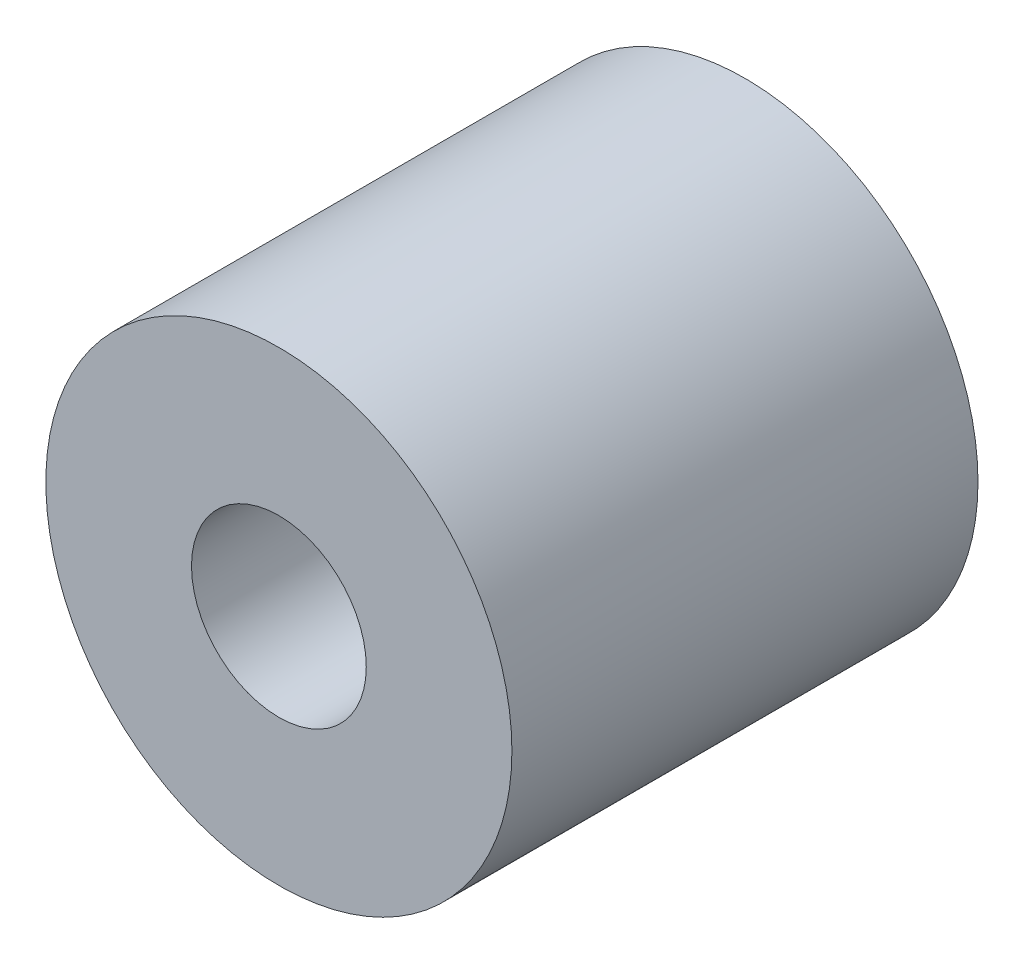
ISO-10303-21;
HEADER;
FILE_DESCRIPTION(('STEP AP214'),'2;1');
FILE_NAME('part.step','',(''),(''),'','','');
FILE_SCHEMA(('AUTOMOTIVE_DESIGN { 1 0 10303 214 1 1 1 1 }'));
ENDSEC;
DATA;
#1=APPLICATION_CONTEXT('core data for automotive mechanical design processes');
#2=APPLICATION_PROTOCOL_DEFINITION('international standard','automotive_design',2000,#1);
#3=PRODUCT_CONTEXT('',#1,'mechanical');
#4=PRODUCT('Part','Part','',(#3));
#5=PRODUCT_RELATED_PRODUCT_CATEGORY('part','',(#4));
#6=PRODUCT_DEFINITION_FORMATION('','',#4);
#7=PRODUCT_DEFINITION_CONTEXT('part definition',#1,'design');
#8=PRODUCT_DEFINITION('design','',#6,#7);
#9=PRODUCT_DEFINITION_SHAPE('','',#8);
#10=(LENGTH_UNIT() NAMED_UNIT(*) SI_UNIT(.MILLI.,.METRE.));
#11=(NAMED_UNIT(*) PLANE_ANGLE_UNIT() SI_UNIT($,.RADIAN.));
#12=(NAMED_UNIT(*) SI_UNIT($,.STERADIAN.) SOLID_ANGLE_UNIT());
#13=UNCERTAINTY_MEASURE_WITH_UNIT(LENGTH_MEASURE(1.E-05),#10,'distance_accuracy_value','');
#14=(GEOMETRIC_REPRESENTATION_CONTEXT(3) GLOBAL_UNCERTAINTY_ASSIGNED_CONTEXT((#13)) GLOBAL_UNIT_ASSIGNED_CONTEXT((#10,
#11,#12)) REPRESENTATION_CONTEXT('',''));
#15=CARTESIAN_POINT('',(0.,0.,0.));
#16=DIRECTION('',(0.,0.,1.));
#17=DIRECTION('',(1.,0.,0.));
#18=AXIS2_PLACEMENT_3D('',#15,#16,#17);
#19=CARTESIAN_POINT('',(0.,0.,8.));
#20=DIRECTION('',(0.,0.,1.));
#21=DIRECTION('',(1.,0.,0.));
#22=AXIS2_PLACEMENT_3D('',#19,#20,#21);
#23=PLANE('',#22);
#24=CARTESIAN_POINT('',(0.,0.,8.));
#25=DIRECTION('',(0.,0.,1.));
#26=DIRECTION('',(1.,0.,0.));
#27=AXIS2_PLACEMENT_3D('',#24,#25,#26);
#28=CIRCLE('',#27,4.);
#29=CARTESIAN_POINT('',(4.,0.,8.));
#30=VERTEX_POINT('',#29);
#31=EDGE_CURVE('E10',#30,#30,#28,.T.);
#32=ORIENTED_EDGE('',*,*,#31,.T.);
#33=EDGE_LOOP('',(#32));
#34=FACE_BOUND('',#33,.T.);
#35=CARTESIAN_POINT('',(0.,0.,8.));
#36=DIRECTION('',(0.,0.,1.));
#37=DIRECTION('',(1.,0.,0.));
#38=AXIS2_PLACEMENT_3D('',#35,#36,#37);
#39=CIRCLE('',#38,1.5);
#40=CARTESIAN_POINT('',(1.5,0.,8.));
#41=VERTEX_POINT('',#40);
#42=EDGE_CURVE('E44',#41,#41,#39,.T.);
#43=ORIENTED_EDGE('',*,*,#42,.F.);
#44=EDGE_LOOP('',(#43));
#45=FACE_BOUND('',#44,.T.);
#46=ADVANCED_FACE('F33',(#34,#45),#23,.T.);
#47=CARTESIAN_POINT('',(0.,0.,0.));
#48=DIRECTION('',(0.,0.,1.));
#49=DIRECTION('',(1.,0.,0.));
#50=AXIS2_PLACEMENT_3D('',#47,#48,#49);
#51=PLANE('',#50);
#52=CARTESIAN_POINT('',(0.,0.,0.));
#53=DIRECTION('',(0.,0.,1.));
#54=DIRECTION('',(1.,0.,0.));
#55=AXIS2_PLACEMENT_3D('',#52,#53,#54);
#56=CIRCLE('',#55,4.);
#57=CARTESIAN_POINT('',(4.,0.,0.));
#58=VERTEX_POINT('',#57);
#59=EDGE_CURVE('E37',#58,#58,#56,.T.);
#60=ORIENTED_EDGE('',*,*,#59,.F.);
#61=EDGE_LOOP('',(#60));
#62=FACE_BOUND('',#61,.T.);
#63=CARTESIAN_POINT('',(0.,0.,0.));
#64=DIRECTION('',(0.,0.,1.));
#65=DIRECTION('',(1.,0.,0.));
#66=AXIS2_PLACEMENT_3D('',#63,#64,#65);
#67=CIRCLE('',#66,1.5);
#68=CARTESIAN_POINT('',(1.5,0.,0.));
#69=VERTEX_POINT('',#68);
#70=EDGE_CURVE('E46',#69,#69,#67,.T.);
#71=ORIENTED_EDGE('',*,*,#70,.T.);
#72=EDGE_LOOP('',(#71));
#73=FACE_BOUND('',#72,.T.);
#74=ADVANCED_FACE('F56',(#62,#73),#51,.F.);
#75=CARTESIAN_POINT('',(0.,0.,8.));
#76=DIRECTION('',(0.,0.,-1.));
#77=DIRECTION('',(-1.,0.,0.));
#78=AXIS2_PLACEMENT_3D('',#75,#76,#77);
#79=CYLINDRICAL_SURFACE('',#78,4.);
#80=ORIENTED_EDGE('',*,*,#31,.F.);
#81=EDGE_LOOP('',(#80));
#82=FACE_BOUND('',#81,.T.);
#83=ORIENTED_EDGE('',*,*,#59,.T.);
#84=EDGE_LOOP('',(#83));
#85=FACE_BOUND('',#84,.T.);
#86=ADVANCED_FACE('F35',(#82,#85),#79,.T.);
#87=CARTESIAN_POINT('',(0.,0.,8.));
#88=DIRECTION('',(0.,0.,-1.));
#89=DIRECTION('',(-1.,0.,0.));
#90=AXIS2_PLACEMENT_3D('',#87,#88,#89);
#91=CYLINDRICAL_SURFACE('',#90,1.5);
#92=ORIENTED_EDGE('',*,*,#42,.T.);
#93=EDGE_LOOP('',(#92));
#94=FACE_BOUND('',#93,.T.);
#95=ORIENTED_EDGE('',*,*,#70,.F.);
#96=EDGE_LOOP('',(#95));
#97=FACE_BOUND('',#96,.T.);
#98=ADVANCED_FACE('F52',(#94,#97),#91,.F.);
#99=CLOSED_SHELL('',(#46,#74,#86,#98));
#100=MANIFOLD_SOLID_BREP('B2',#99);
#101=ADVANCED_BREP_SHAPE_REPRESENTATION('',(#18,#100),#14);
#102=SHAPE_DEFINITION_REPRESENTATION(#9,#101);
ENDSEC;
END-ISO-10303-21;
